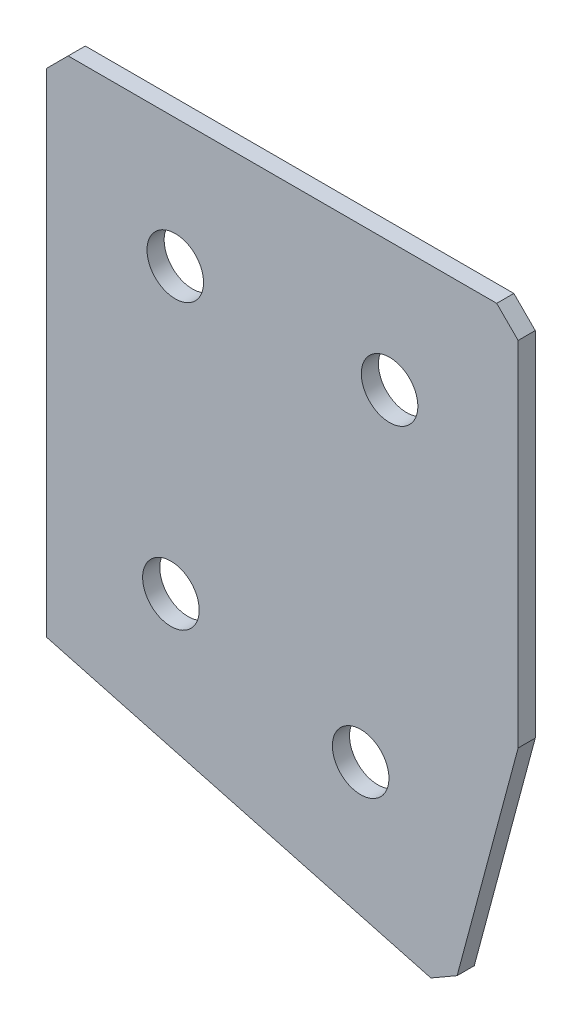
ISO-10303-21;
HEADER;
FILE_DESCRIPTION(('STEP AP214'),'2;1');
FILE_NAME('part.step','',(''),(''),'','','');
FILE_SCHEMA(('AUTOMOTIVE_DESIGN { 1 0 10303 214 1 1 1 1 }'));
ENDSEC;
DATA;
#1=APPLICATION_CONTEXT('core data for automotive mechanical design processes');
#2=APPLICATION_PROTOCOL_DEFINITION('international standard','automotive_design',2000,#1);
#3=PRODUCT_CONTEXT('',#1,'mechanical');
#4=PRODUCT('Part','Part','',(#3));
#5=PRODUCT_RELATED_PRODUCT_CATEGORY('part','',(#4));
#6=PRODUCT_DEFINITION_FORMATION('','',#4);
#7=PRODUCT_DEFINITION_CONTEXT('part definition',#1,'design');
#8=PRODUCT_DEFINITION('design','',#6,#7);
#9=PRODUCT_DEFINITION_SHAPE('','',#8);
#10=(LENGTH_UNIT() NAMED_UNIT(*) SI_UNIT(.MILLI.,.METRE.));
#11=(NAMED_UNIT(*) PLANE_ANGLE_UNIT() SI_UNIT($,.RADIAN.));
#12=(NAMED_UNIT(*) SI_UNIT($,.STERADIAN.) SOLID_ANGLE_UNIT());
#13=UNCERTAINTY_MEASURE_WITH_UNIT(LENGTH_MEASURE(1.E-05),#10,'distance_accuracy_value','');
#14=(GEOMETRIC_REPRESENTATION_CONTEXT(3) GLOBAL_UNCERTAINTY_ASSIGNED_CONTEXT((#13)) GLOBAL_UNIT_ASSIGNED_CONTEXT((#10,
#11,#12)) REPRESENTATION_CONTEXT('',''));
#15=CARTESIAN_POINT('',(0.,0.,0.));
#16=DIRECTION('',(0.,0.,1.));
#17=DIRECTION('',(1.,0.,0.));
#18=AXIS2_PLACEMENT_3D('',#15,#16,#17);
#19=CARTESIAN_POINT('',(0.,0.,-2.));
#20=DIRECTION('',(1.,0.,0.));
#21=DIRECTION('',(0.,0.,-1.));
#22=AXIS2_PLACEMENT_3D('',#19,#20,#21);
#23=PLANE('',#22);
#24=DIRECTION('',(0.,1.,0.));
#25=VECTOR('',#24,1.);
#26=CARTESIAN_POINT('',(0.,0.,0.));
#27=LINE('',#26,#25);
#28=CARTESIAN_POINT('',(0.,-60.,0.));
#29=VERTEX_POINT('',#28);
#30=CARTESIAN_POINT('',(0.,-2.50000000000002,0.));
#31=VERTEX_POINT('',#30);
#32=EDGE_CURVE('E129',#29,#31,#27,.T.);
#33=ORIENTED_EDGE('',*,*,#32,.T.);
#34=DIRECTION('',(0.,0.,-1.));
#35=VECTOR('',#34,1.);
#36=CARTESIAN_POINT('',(0.,-2.50000000000002,-2.));
#37=LINE('',#36,#35);
#38=CARTESIAN_POINT('',(0.,-2.50000000000002,-2.));
#39=VERTEX_POINT('',#38);
#40=EDGE_CURVE('E11',#31,#39,#37,.T.);
#41=ORIENTED_EDGE('',*,*,#40,.T.);
#42=DIRECTION('',(0.,1.,0.));
#43=VECTOR('',#42,1.);
#44=CARTESIAN_POINT('',(0.,0.,-2.));
#45=LINE('',#44,#43);
#46=CARTESIAN_POINT('',(0.,-60.,-2.));
#47=VERTEX_POINT('',#46);
#48=EDGE_CURVE('E140',#47,#39,#45,.T.);
#49=ORIENTED_EDGE('',*,*,#48,.F.);
#50=DIRECTION('',(0.,0.,1.));
#51=VECTOR('',#50,1.);
#52=CARTESIAN_POINT('',(0.,-60.,-2.));
#53=LINE('',#52,#51);
#54=EDGE_CURVE('E119',#47,#29,#53,.T.);
#55=ORIENTED_EDGE('',*,*,#54,.T.);
#56=EDGE_LOOP('',(#33,#41,#49,#55));
#57=FACE_BOUND('',#56,.T.);
#58=ADVANCED_FACE('F36',(#57),#23,.F.);
#59=CARTESIAN_POINT('',(0.,0.,-2.));
#60=DIRECTION('',(0.,-1.,0.));
#61=DIRECTION('',(0.,0.,-1.));
#62=AXIS2_PLACEMENT_3D('',#59,#60,#61);
#63=PLANE('',#62);
#64=DIRECTION('',(1.,0.,0.));
#65=VECTOR('',#64,1.);
#66=CARTESIAN_POINT('',(0.,0.,0.));
#67=LINE('',#66,#65);
#68=CARTESIAN_POINT('',(2.50000000000002,0.,0.));
#69=VERTEX_POINT('',#68);
#70=CARTESIAN_POINT('',(52.5,0.,0.));
#71=VERTEX_POINT('',#70);
#72=EDGE_CURVE('E132',#69,#71,#67,.T.);
#73=ORIENTED_EDGE('',*,*,#72,.T.);
#74=DIRECTION('',(0.,0.,-1.));
#75=VECTOR('',#74,1.);
#76=CARTESIAN_POINT('',(52.5,0.,-2.));
#77=LINE('',#76,#75);
#78=CARTESIAN_POINT('',(52.5,0.,-2.));
#79=VERTEX_POINT('',#78);
#80=EDGE_CURVE('E44',#71,#79,#77,.T.);
#81=ORIENTED_EDGE('',*,*,#80,.T.);
#82=DIRECTION('',(1.,0.,0.));
#83=VECTOR('',#82,1.);
#84=CARTESIAN_POINT('',(0.,0.,-2.));
#85=LINE('',#84,#83);
#86=CARTESIAN_POINT('',(2.50000000000002,0.,-2.));
#87=VERTEX_POINT('',#86);
#88=EDGE_CURVE('E108',#87,#79,#85,.T.);
#89=ORIENTED_EDGE('',*,*,#88,.F.);
#90=DIRECTION('',(0.,0.,1.));
#91=VECTOR('',#90,1.);
#92=CARTESIAN_POINT('',(2.50000000000002,0.,-2.));
#93=LINE('',#92,#91);
#94=EDGE_CURVE('E159',#87,#69,#93,.T.);
#95=ORIENTED_EDGE('',*,*,#94,.T.);
#96=EDGE_LOOP('',(#73,#81,#89,#95));
#97=FACE_BOUND('',#96,.T.);
#98=ADVANCED_FACE('F163',(#97),#63,.F.);
#99=CARTESIAN_POINT('',(55.,0.,-2.));
#100=DIRECTION('',(-1.,0.,0.));
#101=DIRECTION('',(0.,-1.,0.));
#102=AXIS2_PLACEMENT_3D('',#99,#100,#101);
#103=PLANE('',#102);
#104=DIRECTION('',(0.,-1.,0.));
#105=VECTOR('',#104,1.);
#106=CARTESIAN_POINT('',(55.,0.,-2.));
#107=LINE('',#106,#105);
#108=CARTESIAN_POINT('',(55.,-2.50000000000003,-2.));
#109=VERTEX_POINT('',#108);
#110=CARTESIAN_POINT('',(55.,-43.6789201714093,-2.));
#111=VERTEX_POINT('',#110);
#112=EDGE_CURVE('E99',#109,#111,#107,.T.);
#113=ORIENTED_EDGE('',*,*,#112,.F.);
#114=DIRECTION('',(0.,0.,1.));
#115=VECTOR('',#114,1.);
#116=CARTESIAN_POINT('',(55.,-2.50000000000003,-2.));
#117=LINE('',#116,#115);
#118=CARTESIAN_POINT('',(55.,-2.50000000000003,0.));
#119=VERTEX_POINT('',#118);
#120=EDGE_CURVE('E157',#109,#119,#117,.T.);
#121=ORIENTED_EDGE('',*,*,#120,.T.);
#122=DIRECTION('',(0.,-1.,0.));
#123=VECTOR('',#122,1.);
#124=CARTESIAN_POINT('',(55.,0.,0.));
#125=LINE('',#124,#123);
#126=CARTESIAN_POINT('',(55.,-43.6789201714093,0.));
#127=VERTEX_POINT('',#126);
#128=EDGE_CURVE('E114',#119,#127,#125,.T.);
#129=ORIENTED_EDGE('',*,*,#128,.T.);
#130=DIRECTION('',(0.,0.,1.));
#131=VECTOR('',#130,1.);
#132=CARTESIAN_POINT('',(55.,-43.6789201714093,-2.));
#133=LINE('',#132,#131);
#134=EDGE_CURVE('E111',#111,#127,#133,.T.);
#135=ORIENTED_EDGE('',*,*,#134,.F.);
#136=EDGE_LOOP('',(#113,#121,#129,#135));
#137=FACE_BOUND('',#136,.T.);
#138=ADVANCED_FACE('F112',(#137),#103,.F.);
#139=CARTESIAN_POINT('',(47.2354286469243,-72.6566949600813,-2.));
#140=DIRECTION('',(-0.965925826289068,0.258819045102522,0.));
#141=DIRECTION('',(-0.258819045102522,-0.965925826289068,0.));
#142=AXIS2_PLACEMENT_3D('',#139,#140,#141);
#143=PLANE('',#142);
#144=DIRECTION('',(-0.258819045102522,-0.965925826289068,0.));
#145=VECTOR('',#144,1.);
#146=CARTESIAN_POINT('',(47.2354286469243,-72.6566949600813,0.));
#147=LINE('',#146,#145);
#148=CARTESIAN_POINT('',(47.8824762596807,-70.2418803943587,0.));
#149=VERTEX_POINT('',#148);
#150=EDGE_CURVE('E136',#127,#149,#147,.T.);
#151=ORIENTED_EDGE('',*,*,#150,.T.);
#152=DIRECTION('',(0.,0.,-1.));
#153=VECTOR('',#152,1.);
#154=CARTESIAN_POINT('',(47.8824762596807,-70.2418803943587,-2.));
#155=LINE('',#154,#153);
#156=CARTESIAN_POINT('',(47.8824762596807,-70.2418803943587,-2.));
#157=VERTEX_POINT('',#156);
#158=EDGE_CURVE('E123',#149,#157,#155,.T.);
#159=ORIENTED_EDGE('',*,*,#158,.T.);
#160=DIRECTION('',(-0.258819045102522,-0.965925826289068,0.));
#161=VECTOR('',#160,1.);
#162=CARTESIAN_POINT('',(47.2354286469243,-72.6566949600813,-2.));
#163=LINE('',#162,#161);
#164=EDGE_CURVE('E103',#111,#157,#163,.T.);
#165=ORIENTED_EDGE('',*,*,#164,.F.);
#166=ORIENTED_EDGE('',*,*,#134,.T.);
#167=EDGE_LOOP('',(#151,#159,#165,#166));
#168=FACE_BOUND('',#167,.T.);
#169=ADVANCED_FACE('F121',(#168),#143,.F.);
#170=CARTESIAN_POINT('',(0.,-60.,-2.));
#171=DIRECTION('',(0.258819045102522,0.965925826289068,0.));
#172=DIRECTION('',(-0.965925826289068,0.258819045102522,0.));
#173=AXIS2_PLACEMENT_3D('',#170,#171,#172);
#174=PLANE('',#173);
#175=DIRECTION('',(-0.965925826289068,0.258819045102522,0.));
#176=VECTOR('',#175,1.);
#177=CARTESIAN_POINT('',(0.,-60.,-2.));
#178=LINE('',#177,#176);
#179=CARTESIAN_POINT('',(44.8206140812017,-72.009647347325,-2.));
#180=VERTEX_POINT('',#179);
#181=EDGE_CURVE('E124',#180,#47,#178,.T.);
#182=ORIENTED_EDGE('',*,*,#181,.F.);
#183=DIRECTION('',(0.,0.,1.));
#184=VECTOR('',#183,1.);
#185=CARTESIAN_POINT('',(44.8206140812017,-72.009647347325,-2.));
#186=LINE('',#185,#184);
#187=CARTESIAN_POINT('',(44.8206140812017,-72.009647347325,0.));
#188=VERTEX_POINT('',#187);
#189=EDGE_CURVE('E118',#180,#188,#186,.T.);
#190=ORIENTED_EDGE('',*,*,#189,.T.);
#191=DIRECTION('',(-0.965925826289068,0.258819045102522,0.));
#192=VECTOR('',#191,1.);
#193=CARTESIAN_POINT('',(0.,-60.,0.));
#194=LINE('',#193,#192);
#195=EDGE_CURVE('E138',#188,#29,#194,.T.);
#196=ORIENTED_EDGE('',*,*,#195,.T.);
#197=ORIENTED_EDGE('',*,*,#54,.F.);
#198=EDGE_LOOP('',(#182,#190,#196,#197));
#199=FACE_BOUND('',#198,.T.);
#200=ADVANCED_FACE('F193',(#199),#174,.F.);
#201=CARTESIAN_POINT('',(0.,0.,-2.));
#202=DIRECTION('',(0.,0.,1.));
#203=DIRECTION('',(1.,0.,0.));
#204=AXIS2_PLACEMENT_3D('',#201,#202,#203);
#205=PLANE('',#204);
#206=CARTESIAN_POINT('',(15.,-15.,-2.));
#207=DIRECTION('',(0.,0.,-1.));
#208=DIRECTION('',(0.,1.,0.));
#209=AXIS2_PLACEMENT_3D('',#206,#207,#208);
#210=CIRCLE('',#209,3.3);
#211=CARTESIAN_POINT('',(15.,-11.7,-2.));
#212=VERTEX_POINT('',#211);
#213=EDGE_CURVE('E225',#212,#212,#210,.T.);
#214=ORIENTED_EDGE('',*,*,#213,.F.);
#215=EDGE_LOOP('',(#214));
#216=FACE_BOUND('',#215,.T.);
#217=CARTESIAN_POINT('',(40.,-15.,-2.));
#218=DIRECTION('',(0.,0.,-1.));
#219=DIRECTION('',(0.,1.,0.));
#220=AXIS2_PLACEMENT_3D('',#217,#218,#219);
#221=CIRCLE('',#220,3.3);
#222=CARTESIAN_POINT('',(40.,-11.7,-2.));
#223=VERTEX_POINT('',#222);
#224=EDGE_CURVE('E227',#223,#223,#221,.T.);
#225=ORIENTED_EDGE('',*,*,#224,.F.);
#226=EDGE_LOOP('',(#225));
#227=FACE_BOUND('',#226,.T.);
#228=CARTESIAN_POINT('',(14.488887394336,-48.3531429703866,-2.));
#229=DIRECTION('',(0.,0.,-1.));
#230=DIRECTION('',(0.,1.,0.));
#231=AXIS2_PLACEMENT_3D('',#228,#229,#230);
#232=CIRCLE('',#231,3.3);
#233=CARTESIAN_POINT('',(14.488887394336,-45.0531429703866,-2.));
#234=VERTEX_POINT('',#233);
#235=EDGE_CURVE('E235',#234,#234,#232,.T.);
#236=ORIENTED_EDGE('',*,*,#235,.F.);
#237=EDGE_LOOP('',(#236));
#238=FACE_BOUND('',#237,.T.);
#239=CARTESIAN_POINT('',(36.6288269291261,-54.2855218892075,-2.));
#240=DIRECTION('',(0.,0.,-1.));
#241=DIRECTION('',(0.,1.,0.));
#242=AXIS2_PLACEMENT_3D('',#239,#240,#241);
#243=CIRCLE('',#242,3.3);
#244=CARTESIAN_POINT('',(36.6288269291261,-50.9855218892075,-2.));
#245=VERTEX_POINT('',#244);
#246=EDGE_CURVE('E241',#245,#245,#243,.T.);
#247=ORIENTED_EDGE('',*,*,#246,.F.);
#248=EDGE_LOOP('',(#247));
#249=FACE_BOUND('',#248,.T.);
#250=ORIENTED_EDGE('',*,*,#164,.T.);
#251=DIRECTION('',(0.866025403784438,0.500000000000001,0.));
#252=VECTOR('',#251,1.);
#253=CARTESIAN_POINT('',(44.8206140812017,-72.009647347325,-2.));
#254=LINE('',#253,#252);
#255=EDGE_CURVE('E155',#157,#180,#254,.F.);
#256=ORIENTED_EDGE('',*,*,#255,.T.);
#257=ORIENTED_EDGE('',*,*,#181,.T.);
#258=ORIENTED_EDGE('',*,*,#48,.T.);
#259=DIRECTION('',(-0.707106781186548,-0.707106781186548,0.));
#260=VECTOR('',#259,1.);
#261=CARTESIAN_POINT('',(2.50000000000002,0.,-2.));
#262=LINE('',#261,#260);
#263=EDGE_CURVE('E152',#39,#87,#262,.F.);
#264=ORIENTED_EDGE('',*,*,#263,.T.);
#265=ORIENTED_EDGE('',*,*,#88,.T.);
#266=DIRECTION('',(-0.707106781186548,0.707106781186548,0.));
#267=VECTOR('',#266,1.);
#268=CARTESIAN_POINT('',(55.,-2.50000000000003,-2.));
#269=LINE('',#268,#267);
#270=EDGE_CURVE('E51',#79,#109,#269,.F.);
#271=ORIENTED_EDGE('',*,*,#270,.T.);
#272=ORIENTED_EDGE('',*,*,#112,.T.);
#273=EDGE_LOOP('',(#250,#256,#257,#258,#264,#265,#271,#272));
#274=FACE_BOUND('',#273,.T.);
#275=ADVANCED_FACE('F101',(#216,#227,#238,#249,#274),#205,.F.);
#276=CARTESIAN_POINT('',(0.,0.,0.));
#277=DIRECTION('',(0.,0.,1.));
#278=DIRECTION('',(1.,0.,0.));
#279=AXIS2_PLACEMENT_3D('',#276,#277,#278);
#280=PLANE('',#279);
#281=CARTESIAN_POINT('',(15.,-15.,0.));
#282=DIRECTION('',(0.,0.,-1.));
#283=DIRECTION('',(0.,1.,0.));
#284=AXIS2_PLACEMENT_3D('',#281,#282,#283);
#285=CIRCLE('',#284,3.3);
#286=CARTESIAN_POINT('',(15.,-11.7,0.));
#287=VERTEX_POINT('',#286);
#288=EDGE_CURVE('E222',#287,#287,#285,.T.);
#289=ORIENTED_EDGE('',*,*,#288,.T.);
#290=EDGE_LOOP('',(#289));
#291=FACE_BOUND('',#290,.T.);
#292=CARTESIAN_POINT('',(40.,-15.,0.));
#293=DIRECTION('',(0.,0.,-1.));
#294=DIRECTION('',(0.,1.,0.));
#295=AXIS2_PLACEMENT_3D('',#292,#293,#294);
#296=CIRCLE('',#295,3.3);
#297=CARTESIAN_POINT('',(40.,-11.7,0.));
#298=VERTEX_POINT('',#297);
#299=EDGE_CURVE('E232',#298,#298,#296,.T.);
#300=ORIENTED_EDGE('',*,*,#299,.T.);
#301=EDGE_LOOP('',(#300));
#302=FACE_BOUND('',#301,.T.);
#303=CARTESIAN_POINT('',(14.488887394336,-48.3531429703866,0.));
#304=DIRECTION('',(0.,0.,-1.));
#305=DIRECTION('',(0.,1.,0.));
#306=AXIS2_PLACEMENT_3D('',#303,#304,#305);
#307=CIRCLE('',#306,3.3);
#308=CARTESIAN_POINT('',(14.488887394336,-45.0531429703866,0.));
#309=VERTEX_POINT('',#308);
#310=EDGE_CURVE('E238',#309,#309,#307,.T.);
#311=ORIENTED_EDGE('',*,*,#310,.T.);
#312=EDGE_LOOP('',(#311));
#313=FACE_BOUND('',#312,.T.);
#314=CARTESIAN_POINT('',(36.6288269291261,-54.2855218892075,0.));
#315=DIRECTION('',(0.,0.,-1.));
#316=DIRECTION('',(0.,1.,0.));
#317=AXIS2_PLACEMENT_3D('',#314,#315,#316);
#318=CIRCLE('',#317,3.3);
#319=CARTESIAN_POINT('',(36.6288269291261,-50.9855218892075,0.));
#320=VERTEX_POINT('',#319);
#321=EDGE_CURVE('E133',#320,#320,#318,.T.);
#322=ORIENTED_EDGE('',*,*,#321,.T.);
#323=EDGE_LOOP('',(#322));
#324=FACE_BOUND('',#323,.T.);
#325=ORIENTED_EDGE('',*,*,#195,.F.);
#326=DIRECTION('',(-0.866025403784438,-0.500000000000001,0.));
#327=VECTOR('',#326,1.);
#328=CARTESIAN_POINT('',(42.3862454804716,-73.4151307142633,0.));
#329=LINE('',#328,#327);
#330=EDGE_CURVE('E149',#188,#149,#329,.F.);
#331=ORIENTED_EDGE('',*,*,#330,.T.);
#332=ORIENTED_EDGE('',*,*,#150,.F.);
#333=ORIENTED_EDGE('',*,*,#128,.F.);
#334=DIRECTION('',(0.707106781186548,-0.707106781186548,0.));
#335=VECTOR('',#334,1.);
#336=CARTESIAN_POINT('',(26.25,26.25,0.));
#337=LINE('',#336,#335);
#338=EDGE_CURVE('E147',#119,#71,#337,.F.);
#339=ORIENTED_EDGE('',*,*,#338,.T.);
#340=ORIENTED_EDGE('',*,*,#72,.F.);
#341=DIRECTION('',(0.707106781186548,0.707106781186548,0.));
#342=VECTOR('',#341,1.);
#343=CARTESIAN_POINT('',(1.25000000000001,-1.25000000000001,0.));
#344=LINE('',#343,#342);
#345=EDGE_CURVE('E145',#69,#31,#344,.F.);
#346=ORIENTED_EDGE('',*,*,#345,.T.);
#347=ORIENTED_EDGE('',*,*,#32,.F.);
#348=EDGE_LOOP('',(#325,#331,#332,#333,#339,#340,#346,#347));
#349=FACE_BOUND('',#348,.T.);
#350=ADVANCED_FACE('F168',(#291,#302,#313,#324,#349),#280,.T.);
#351=CARTESIAN_POINT('',(36.6288269291261,-54.2855218892075,-2.));
#352=DIRECTION('',(0.,0.,-1.));
#353=DIRECTION('',(0.,1.,0.));
#354=AXIS2_PLACEMENT_3D('',#351,#352,#353);
#355=CYLINDRICAL_SURFACE('',#354,3.3);
#356=ORIENTED_EDGE('',*,*,#321,.F.);
#357=EDGE_LOOP('',(#356));
#358=FACE_BOUND('',#357,.T.);
#359=ORIENTED_EDGE('',*,*,#246,.T.);
#360=EDGE_LOOP('',(#359));
#361=FACE_BOUND('',#360,.T.);
#362=ADVANCED_FACE('F199',(#358,#361),#355,.F.);
#363=CARTESIAN_POINT('',(14.488887394336,-48.3531429703866,-2.));
#364=DIRECTION('',(0.,0.,-1.));
#365=DIRECTION('',(0.,1.,0.));
#366=AXIS2_PLACEMENT_3D('',#363,#364,#365);
#367=CYLINDRICAL_SURFACE('',#366,3.3);
#368=ORIENTED_EDGE('',*,*,#310,.F.);
#369=EDGE_LOOP('',(#368));
#370=FACE_BOUND('',#369,.T.);
#371=ORIENTED_EDGE('',*,*,#235,.T.);
#372=EDGE_LOOP('',(#371));
#373=FACE_BOUND('',#372,.T.);
#374=ADVANCED_FACE('F206',(#370,#373),#367,.F.);
#375=CARTESIAN_POINT('',(40.,-15.,-2.));
#376=DIRECTION('',(0.,0.,-1.));
#377=DIRECTION('',(0.,1.,0.));
#378=AXIS2_PLACEMENT_3D('',#375,#376,#377);
#379=CYLINDRICAL_SURFACE('',#378,3.3);
#380=ORIENTED_EDGE('',*,*,#299,.F.);
#381=EDGE_LOOP('',(#380));
#382=FACE_BOUND('',#381,.T.);
#383=ORIENTED_EDGE('',*,*,#224,.T.);
#384=EDGE_LOOP('',(#383));
#385=FACE_BOUND('',#384,.T.);
#386=ADVANCED_FACE('F210',(#382,#385),#379,.F.);
#387=CARTESIAN_POINT('',(15.,-15.,-2.));
#388=DIRECTION('',(0.,0.,-1.));
#389=DIRECTION('',(0.,1.,0.));
#390=AXIS2_PLACEMENT_3D('',#387,#388,#389);
#391=CYLINDRICAL_SURFACE('',#390,3.3);
#392=ORIENTED_EDGE('',*,*,#288,.F.);
#393=EDGE_LOOP('',(#392));
#394=FACE_BOUND('',#393,.T.);
#395=ORIENTED_EDGE('',*,*,#213,.T.);
#396=EDGE_LOOP('',(#395));
#397=FACE_BOUND('',#396,.T.);
#398=ADVANCED_FACE('F178',(#394,#397),#391,.F.);
#399=CARTESIAN_POINT('',(44.8206140812017,-72.009647347325,-2.));
#400=DIRECTION('',(-0.500000000000001,0.866025403784438,0.));
#401=DIRECTION('',(0.,0.,1.));
#402=AXIS2_PLACEMENT_3D('',#399,#400,#401);
#403=PLANE('',#402);
#404=ORIENTED_EDGE('',*,*,#255,.F.);
#405=ORIENTED_EDGE('',*,*,#158,.F.);
#406=ORIENTED_EDGE('',*,*,#330,.F.);
#407=ORIENTED_EDGE('',*,*,#189,.F.);
#408=EDGE_LOOP('',(#404,#405,#406,#407));
#409=FACE_BOUND('',#408,.T.);
#410=ADVANCED_FACE('F173',(#409),#403,.F.);
#411=CARTESIAN_POINT('',(55.,-2.50000000000003,-2.));
#412=DIRECTION('',(-0.707106781186547,-0.707106781186547,0.));
#413=DIRECTION('',(0.,0.,1.));
#414=AXIS2_PLACEMENT_3D('',#411,#412,#413);
#415=PLANE('',#414);
#416=ORIENTED_EDGE('',*,*,#270,.F.);
#417=ORIENTED_EDGE('',*,*,#80,.F.);
#418=ORIENTED_EDGE('',*,*,#338,.F.);
#419=ORIENTED_EDGE('',*,*,#120,.F.);
#420=EDGE_LOOP('',(#416,#417,#418,#419));
#421=FACE_BOUND('',#420,.T.);
#422=ADVANCED_FACE('F171',(#421),#415,.F.);
#423=CARTESIAN_POINT('',(2.50000000000002,0.,-2.));
#424=DIRECTION('',(0.707106781186547,-0.707106781186547,0.));
#425=DIRECTION('',(0.,0.,1.));
#426=AXIS2_PLACEMENT_3D('',#423,#424,#425);
#427=PLANE('',#426);
#428=ORIENTED_EDGE('',*,*,#263,.F.);
#429=ORIENTED_EDGE('',*,*,#40,.F.);
#430=ORIENTED_EDGE('',*,*,#345,.F.);
#431=ORIENTED_EDGE('',*,*,#94,.F.);
#432=EDGE_LOOP('',(#428,#429,#430,#431));
#433=FACE_BOUND('',#432,.T.);
#434=ADVANCED_FACE('F38',(#433),#427,.F.);
#435=CLOSED_SHELL('',(#58,#98,#138,#169,#200,#275,#350,#362,#374,#386,#398,#410,#422,#434));
#436=MANIFOLD_SOLID_BREP('B2',#435);
#437=ADVANCED_BREP_SHAPE_REPRESENTATION('',(#18,#436),#14);
#438=SHAPE_DEFINITION_REPRESENTATION(#9,#437);
ENDSEC;
END-ISO-10303-21;
